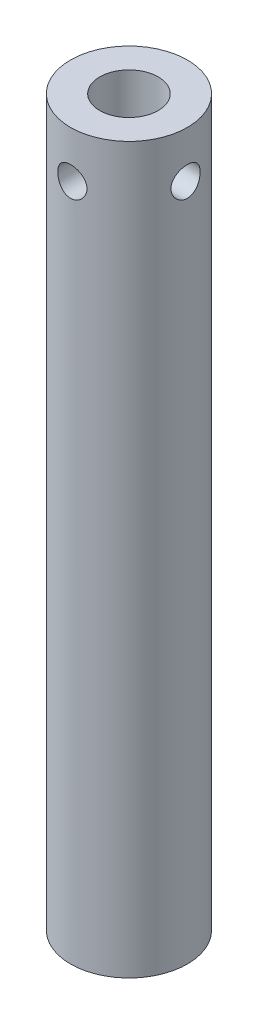
ISO-10303-21;
HEADER;
FILE_DESCRIPTION(('STEP AP214'),'2;1');
FILE_NAME('part.step','',(''),(''),'','','');
FILE_SCHEMA(('AUTOMOTIVE_DESIGN { 1 0 10303 214 1 1 1 1 }'));
ENDSEC;
DATA;
#1=APPLICATION_CONTEXT('core data for automotive mechanical design processes');
#2=APPLICATION_PROTOCOL_DEFINITION('international standard','automotive_design',2000,#1);
#3=PRODUCT_CONTEXT('',#1,'mechanical');
#4=PRODUCT('Part','Part','',(#3));
#5=PRODUCT_RELATED_PRODUCT_CATEGORY('part','',(#4));
#6=PRODUCT_DEFINITION_FORMATION('','',#4);
#7=PRODUCT_DEFINITION_CONTEXT('part definition',#1,'design');
#8=PRODUCT_DEFINITION('design','',#6,#7);
#9=PRODUCT_DEFINITION_SHAPE('','',#8);
#10=(LENGTH_UNIT() NAMED_UNIT(*) SI_UNIT(.MILLI.,.METRE.));
#11=(NAMED_UNIT(*) PLANE_ANGLE_UNIT() SI_UNIT($,.RADIAN.));
#12=(NAMED_UNIT(*) SI_UNIT($,.STERADIAN.) SOLID_ANGLE_UNIT());
#13=UNCERTAINTY_MEASURE_WITH_UNIT(LENGTH_MEASURE(1.E-05),#10,'distance_accuracy_value','');
#14=(GEOMETRIC_REPRESENTATION_CONTEXT(3) GLOBAL_UNCERTAINTY_ASSIGNED_CONTEXT((#13)) GLOBAL_UNIT_ASSIGNED_CONTEXT((#10,
#11,#12)) REPRESENTATION_CONTEXT('',''));
#15=CARTESIAN_POINT('',(0.,0.,0.));
#16=DIRECTION('',(0.,0.,1.));
#17=DIRECTION('',(1.,0.,0.));
#18=AXIS2_PLACEMENT_3D('',#15,#16,#17);
#19=CARTESIAN_POINT('',(0.,62.,0.));
#20=DIRECTION('',(0.,-1.,0.));
#21=DIRECTION('',(0.,0.,-1.));
#22=AXIS2_PLACEMENT_3D('',#19,#20,#21);
#23=CYLINDRICAL_SURFACE('',#22,5.);
#24=CARTESIAN_POINT('',(4.84122918275927,58.,-1.24999999999999));
#25=CARTESIAN_POINT('',(4.84123050042654,57.9309746245377,-1.24999803929588));
#26=CARTESIAN_POINT('',(4.84272153006957,57.861927550661,-1.24426312274865));
#27=CARTESIAN_POINT('',(4.84850930996624,57.725816210913,-1.22151156273207));
#28=CARTESIAN_POINT('',(4.85280769310907,57.6587531227658,-1.20448835337109));
#29=CARTESIAN_POINT('',(4.86369362297984,57.5285982309065,-1.15974559981597));
#30=CARTESIAN_POINT('',(4.87027821345204,57.4655014223072,-1.13203986392723));
#31=CARTESIAN_POINT('',(4.88499096014404,57.34484457373,-1.0667605706307));
#32=CARTESIAN_POINT('',(4.89311918189251,57.2872847689599,-1.02918659428035));
#33=CARTESIAN_POINT('',(4.91020358177806,57.1780691773689,-0.944354213655936));
#34=CARTESIAN_POINT('',(4.91917298811515,57.126553199825,-0.896918443852022));
#35=CARTESIAN_POINT('',(4.93681437757649,57.0321193028198,-0.79409103205033));
#36=CARTESIAN_POINT('',(4.94548633283195,56.9892021871891,-0.738698647090153));
#37=CARTESIAN_POINT('',(4.96170207760291,56.9126122661844,-0.62057260053948));
#38=CARTESIAN_POINT('',(4.96922843700296,56.8790768059193,-0.557747288097565));
#39=CARTESIAN_POINT('',(4.98215405962992,56.8230951779235,-0.427131592146387));
#40=CARTESIAN_POINT('',(4.98755363667172,56.8006473740422,-0.359341942895976));
#41=CARTESIAN_POINT('',(4.9955237942409,56.7679260827107,-0.222179379377086));
#42=CARTESIAN_POINT('',(4.99814946922157,56.7574151778367,-0.152866359774493));
#43=CARTESIAN_POINT('',(5.00046797053649,56.7481208103622,-0.0134144096313907));
#44=CARTESIAN_POINT('',(5.00016123048352,56.7493356138952,0.0567243972690281));
#45=CARTESIAN_POINT('',(4.99669047476767,56.7632874251251,0.194190308965478));
#46=CARTESIAN_POINT('',(4.99359001170437,56.7757681625269,0.261545269501328));
#47=CARTESIAN_POINT('',(4.98495418262427,56.8114856350242,0.393172809267101));
#48=CARTESIAN_POINT('',(4.9794186869922,56.8347229426887,0.45744522421304));
#49=CARTESIAN_POINT('',(4.96643754850448,56.8915012853435,0.581758379377251));
#50=CARTESIAN_POINT('',(4.95897509847527,56.9251335223309,0.641755637208124));
#51=CARTESIAN_POINT('',(4.94294951904825,57.0016778395581,0.755344527925604));
#52=CARTESIAN_POINT('',(4.93438619826245,57.0445915342803,0.808935043856874));
#53=CARTESIAN_POINT('',(4.9168185688476,57.1398543709912,0.909717543856188));
#54=CARTESIAN_POINT('',(4.90780859762959,57.1924274461739,0.956697098843993));
#55=CARTESIAN_POINT('',(4.89057521758353,57.3047999867701,1.04122046995377));
#56=CARTESIAN_POINT('',(4.88235184552985,57.3645997897455,1.07876384505751));
#57=CARTESIAN_POINT('',(4.86760248415824,57.4901450170745,1.14348516127824));
#58=CARTESIAN_POINT('',(4.86108491862861,57.5559178651566,1.1706119587131));
#59=CARTESIAN_POINT('',(4.85059320069979,57.6912927340382,1.21335702579542));
#60=CARTESIAN_POINT('',(4.84661850405109,57.7608939319916,1.22897775819113));
#61=CARTESIAN_POINT('',(4.8417767801957,57.8999797507615,1.24791481933258));
#62=CARTESIAN_POINT('',(4.84083044546824,57.9694188966648,1.25154523695981));
#63=CARTESIAN_POINT('',(4.8419367174052,58.1079109682891,1.24725849525777));
#64=CARTESIAN_POINT('',(4.84398904800633,58.1769639289756,1.23934239892439));
#65=CARTESIAN_POINT('',(4.8507854097728,58.3115571324773,1.21246273196883));
#66=CARTESIAN_POINT('',(4.85548485117188,58.3771363632854,1.19368203414087));
#67=CARTESIAN_POINT('',(4.86700359135481,58.5042157289258,1.14580904083531));
#68=CARTESIAN_POINT('',(4.87382314124307,58.5657153795277,1.11671552385627));
#69=CARTESIAN_POINT('',(4.88898068546631,58.6842206389337,1.04838533396828));
#70=CARTESIAN_POINT('',(4.89734584303321,58.7411144200215,1.00896087691782));
#71=CARTESIAN_POINT('',(4.91458541535858,58.8475941814007,0.92132536616807));
#72=CARTESIAN_POINT('',(4.92345991364235,58.897178958325,0.873112868506799));
#73=CARTESIAN_POINT('',(4.94098701515803,58.9889055212855,0.767828401230906));
#74=CARTESIAN_POINT('',(4.94962851030918,59.0308300312744,0.71056494066449));
#75=CARTESIAN_POINT('',(4.96548608306867,59.1044679334756,0.589628353368344));
#76=CARTESIAN_POINT('',(4.9727022350198,59.1361818583041,0.52595556119699));
#77=CARTESIAN_POINT('',(4.98485057869157,59.188223017264,0.394447752163865));
#78=CARTESIAN_POINT('',(4.98979915011205,59.2086321421895,0.326646726284855));
#79=CARTESIAN_POINT('',(4.99692646697894,59.2377301673042,0.188437200398514));
#80=CARTESIAN_POINT('',(4.99910574696704,59.2464213293695,0.11802920630156));
#81=CARTESIAN_POINT('',(5.00042711761014,59.2517094869694,-0.0213544080541514));
#82=CARTESIAN_POINT('',(4.9996497360001,59.2486271363692,-0.0903172837075344));
#83=CARTESIAN_POINT('',(4.9953237057178,59.2311902158821,-0.226709370518417));
#84=CARTESIAN_POINT('',(4.99177513946369,59.2168359812336,-0.294138627226101));
#85=CARTESIAN_POINT('',(4.98231791067453,59.1774347252863,-0.425213794556013));
#86=CARTESIAN_POINT('',(4.97642205628333,59.1524456833567,-0.488878118226267));
#87=CARTESIAN_POINT('',(4.9628911114173,59.0925367762258,-0.611146316301828));
#88=CARTESIAN_POINT('',(4.9552558017217,59.057615659163,-0.669749551581306));
#89=CARTESIAN_POINT('',(4.93884062101666,58.9778559575036,-0.781752410529865));
#90=CARTESIAN_POINT('',(4.93003771182014,58.9327998213658,-0.834993735375722));
#91=CARTESIAN_POINT('',(4.91238311316553,58.8344714350327,-0.93326877533906));
#92=CARTESIAN_POINT('',(4.90353141190695,58.7811971048776,-0.978300406335228));
#93=CARTESIAN_POINT('',(4.88659344825685,58.6667482322483,-1.05970253309903));
#94=CARTESIAN_POINT('',(4.87852454662356,58.6054448457342,-1.09589577430818));
#95=CARTESIAN_POINT('',(4.8642994443827,58.4774306375966,-1.15740862076957));
#96=CARTESIAN_POINT('',(4.85814185308379,58.4107237923666,-1.18273613719964));
#97=CARTESIAN_POINT('',(4.84939885924729,58.2867787352166,-1.21802816070679));
#98=CARTESIAN_POINT('',(4.84635828750683,58.2301335445202,-1.22999146324422));
#99=CARTESIAN_POINT('',(4.84227298231965,58.11566391375,-1.24597786571658));
#100=CARTESIAN_POINT('',(4.84122807862454,58.0578395746937,-1.25000164296522));
#101=CARTESIAN_POINT('',(4.84122918275927,58.,-1.24999999999999));
#102=B_SPLINE_CURVE_WITH_KNOTS('',3,(#24,#25,#26,#27,#28,#29,#30,#31,#32,#33,#34,#35,#36,#37,
#38,#39,#40,#41,#42,#43,#44,#45,#46,#47,#48,#49,#50,#51,#52,#53,#54,#55,#56,#57,#58,#59,#60,#61,
#62,#63,#64,#65,#66,#67,#68,#69,#70,#71,#72,#73,#74,#75,#76,#77,#78,#79,#80,#81,#82,#83,#84,#85,
#86,#87,#88,#89,#90,#91,#92,#93,#94,#95,#96,#97,#98,#99,#100,#101),.UNSPECIFIED.,.T.,.F.,(4,2,2,
2,2,2,2,2,2,2,2,2,2,2,2,2,2,2,2,2,2,2,2,2,2,2,2,2,2,2,2,2,2,2,2,2,2,2,4),(0.,0.206863720868061,
0.413847870714328,0.620565363583002,0.827291633777377,1.03811977096488,1.24896760739932,
1.46275748198959,1.67651579923545,1.88594375497672,2.09534074333009,2.30009131344472,
2.50485278362392,2.71146437127221,2.91811192734455,3.13035233285955,3.34260265599899,
3.55588216004198,3.76911600064771,3.97671787380857,4.18430063591899,4.38848702504601,
4.59269760710706,4.80091422929576,5.00916509442519,5.22262665482657,5.43607707859774,
5.64796036403462,5.85980274454516,6.06591723063725,6.27202558688487,6.47702438279852,
6.68204902869033,6.89198548291032,7.10197515782751,7.31588238642335,7.52963360683305,
7.70298913588661,7.87632987549757),.UNSPECIFIED.);
#103=CARTESIAN_POINT('',(4.84122918275927,58.,-1.24999999999999));
#104=VERTEX_POINT('',#103);
#105=EDGE_CURVE('E112',#104,#104,#102,.T.);
#106=ORIENTED_EDGE('',*,*,#105,.T.);
#107=EDGE_LOOP('',(#106));
#108=FACE_BOUND('',#107,.T.);
#109=CARTESIAN_POINT('',(1.25,58.,4.84122918275927));
#110=CARTESIAN_POINT('',(1.24999803929589,57.9309746245377,4.84123050042654));
#111=CARTESIAN_POINT('',(1.24426312274865,57.861927550661,4.84272153006957));
#112=CARTESIAN_POINT('',(1.22151156273207,57.725816210913,4.84850930996624));
#113=CARTESIAN_POINT('',(1.2044883533711,57.6587531227658,4.85280769310907));
#114=CARTESIAN_POINT('',(1.15974559981597,57.5285982309065,4.86369362297984));
#115=CARTESIAN_POINT('',(1.13203986392723,57.4655014223072,4.87027821345204));
#116=CARTESIAN_POINT('',(1.0667605706307,57.34484457373,4.88499096014404));
#117=CARTESIAN_POINT('',(1.02918659428034,57.2872847689599,4.89311918189251));
#118=CARTESIAN_POINT('',(0.944354213655936,57.1780691773689,4.91020358177806));
#119=CARTESIAN_POINT('',(0.896918443852024,57.126553199825,4.91917298811515));
#120=CARTESIAN_POINT('',(0.794091032050332,57.0321193028198,4.93681437757649));
#121=CARTESIAN_POINT('',(0.738698647090153,56.9892021871891,4.94548633283195));
#122=CARTESIAN_POINT('',(0.620572600539476,56.9126122661844,4.96170207760291));
#123=CARTESIAN_POINT('',(0.557747288097559,56.8790768059193,4.96922843700296));
#124=CARTESIAN_POINT('',(0.42713159214638,56.8230951779234,4.98215405962992));
#125=CARTESIAN_POINT('',(0.35934194289597,56.8006473740422,4.98755363667172));
#126=CARTESIAN_POINT('',(0.222179379377081,56.7679260827107,4.9955237942409));
#127=CARTESIAN_POINT('',(0.152866359774488,56.7574151778367,4.99814946922157));
#128=CARTESIAN_POINT('',(0.0134144096313852,56.7481208103622,5.00046797053649));
#129=CARTESIAN_POINT('',(-0.0567243972690335,56.7493356138952,5.00016123048352));
#130=CARTESIAN_POINT('',(-0.194190308965484,56.7632874251251,4.99669047476767));
#131=CARTESIAN_POINT('',(-0.261545269501334,56.7757681625269,4.99359001170437));
#132=CARTESIAN_POINT('',(-0.393172809267109,56.8114856350242,4.98495418262427));
#133=CARTESIAN_POINT('',(-0.457445224213048,56.8347229426887,4.9794186869922));
#134=CARTESIAN_POINT('',(-0.581758379377259,56.8915012853435,4.96643754850448));
#135=CARTESIAN_POINT('',(-0.641755637208132,56.9251335223309,4.95897509847527));
#136=CARTESIAN_POINT('',(-0.755344527925611,57.0016778395581,4.94294951904825));
#137=CARTESIAN_POINT('',(-0.808935043856881,57.0445915342803,4.93438619826245));
#138=CARTESIAN_POINT('',(-0.909717543856193,57.1398543709912,4.9168185688476));
#139=CARTESIAN_POINT('',(-0.956697098843997,57.1924274461739,4.90780859762959));
#140=CARTESIAN_POINT('',(-1.04122046995377,57.3047999867701,4.89057521758353));
#141=CARTESIAN_POINT('',(-1.07876384505752,57.3645997897455,4.88235184552985));
#142=CARTESIAN_POINT('',(-1.14348516127825,57.4901450170745,4.86760248415824));
#143=CARTESIAN_POINT('',(-1.17061195871311,57.5559178651566,4.8610849186286));
#144=CARTESIAN_POINT('',(-1.21335702579542,57.6912927340382,4.85059320069979));
#145=CARTESIAN_POINT('',(-1.22897775819113,57.7608939319916,4.84661850405109));
#146=CARTESIAN_POINT('',(-1.24791481933259,57.8999797507616,4.8417767801957));
#147=CARTESIAN_POINT('',(-1.25154523695981,57.9694188966648,4.84083044546824));
#148=CARTESIAN_POINT('',(-1.24725849525777,58.1079109682891,4.8419367174052));
#149=CARTESIAN_POINT('',(-1.2393423989244,58.1769639289756,4.84398904800633));
#150=CARTESIAN_POINT('',(-1.21246273196883,58.3115571324773,4.8507854097728));
#151=CARTESIAN_POINT('',(-1.19368203414087,58.3771363632854,4.85548485117188));
#152=CARTESIAN_POINT('',(-1.14580904083531,58.5042157289258,4.86700359135481));
#153=CARTESIAN_POINT('',(-1.11671552385627,58.5657153795277,4.87382314124307));
#154=CARTESIAN_POINT('',(-1.04838533396828,58.6842206389337,4.88898068546631));
#155=CARTESIAN_POINT('',(-1.00896087691781,58.7411144200215,4.89734584303321));
#156=CARTESIAN_POINT('',(-0.921325366168066,58.8475941814007,4.91458541535858));
#157=CARTESIAN_POINT('',(-0.873112868506796,58.897178958325,4.92345991364235));
#158=CARTESIAN_POINT('',(-0.767828401230906,58.9889055212855,4.94098701515803));
#159=CARTESIAN_POINT('',(-0.71056494066449,59.0308300312744,4.94962851030918));
#160=CARTESIAN_POINT('',(-0.589628353368343,59.1044679334756,4.96548608306867));
#161=CARTESIAN_POINT('',(-0.525955561196987,59.1361818583041,4.9727022350198));
#162=CARTESIAN_POINT('',(-0.39444775216386,59.188223017264,4.98485057869157));
#163=CARTESIAN_POINT('',(-0.326646726284848,59.2086321421895,4.98979915011205));
#164=CARTESIAN_POINT('',(-0.188437200398506,59.2377301673042,4.99692646697894));
#165=CARTESIAN_POINT('',(-0.118029206301551,59.2464213293695,4.99910574696704));
#166=CARTESIAN_POINT('',(0.0213544080541615,59.2517094869694,5.00042711761014));
#167=CARTESIAN_POINT('',(0.0903172837075452,59.2486271363692,4.9996497360001));
#168=CARTESIAN_POINT('',(0.226709370518428,59.2311902158821,4.9953237057178));
#169=CARTESIAN_POINT('',(0.294138627226111,59.2168359812336,4.99177513946369));
#170=CARTESIAN_POINT('',(0.425213794556021,59.1774347252863,4.98231791067453));
#171=CARTESIAN_POINT('',(0.488878118226274,59.1524456833567,4.97642205628333));
#172=CARTESIAN_POINT('',(0.611146316301835,59.0925367762258,4.9628911114173));
#173=CARTESIAN_POINT('',(0.669749551581314,59.057615659163,4.9552558017217));
#174=CARTESIAN_POINT('',(0.781752410529876,58.9778559575036,4.93884062101666));
#175=CARTESIAN_POINT('',(0.834993735375734,58.9327998213658,4.93003771182014));
#176=CARTESIAN_POINT('',(0.933268775339073,58.8344714350327,4.91238311316552));
#177=CARTESIAN_POINT('',(0.978300406335241,58.7811971048776,4.90353141190695));
#178=CARTESIAN_POINT('',(1.05970253309904,58.6667482322483,4.88659344825685));
#179=CARTESIAN_POINT('',(1.09589577430819,58.6054448457342,4.87852454662356));
#180=CARTESIAN_POINT('',(1.15740862076958,58.4774306375966,4.8642994443827));
#181=CARTESIAN_POINT('',(1.18273613719965,58.4107237923666,4.85814185308378));
#182=CARTESIAN_POINT('',(1.2180281607068,58.2867787352166,4.84939885924729));
#183=CARTESIAN_POINT('',(1.22999146324422,58.2301335445202,4.84635828750683));
#184=CARTESIAN_POINT('',(1.24597786571659,58.11566391375,4.84227298231965));
#185=CARTESIAN_POINT('',(1.25000164296523,58.0578395746937,4.84122807862454));
#186=CARTESIAN_POINT('',(1.25,58.,4.84122918275927));
#187=B_SPLINE_CURVE_WITH_KNOTS('',3,(#109,#110,#111,#112,#113,#114,#115,#116,#117,#118,#119,
#120,#121,#122,#123,#124,#125,#126,#127,#128,#129,#130,#131,#132,#133,#134,#135,#136,#137,#138,
#139,#140,#141,#142,#143,#144,#145,#146,#147,#148,#149,#150,#151,#152,#153,#154,#155,#156,#157,
#158,#159,#160,#161,#162,#163,#164,#165,#166,#167,#168,#169,#170,#171,#172,#173,#174,#175,#176,
#177,#178,#179,#180,#181,#182,#183,#184,#185,#186),.UNSPECIFIED.,.T.,.F.,(4,2,2,2,2,2,2,2,2,2,2,
2,2,2,2,2,2,2,2,2,2,2,2,2,2,2,2,2,2,2,2,2,2,2,2,2,2,2,4),(0.,0.206863720868061,
0.413847870714335,0.620565363583012,0.827291633777394,1.03811977096488,1.24896760739933,
1.4627574819896,1.67651579923546,1.88594375497673,2.0953407433301,2.30009131344474,
2.50485278362393,2.71146437127222,2.91811192734457,3.13035233285955,3.342602655999,
3.55588216004201,3.76911600064773,3.97671787380858,4.18430063591901,4.38848702504603,
4.59269760710709,4.80091422929579,5.00916509442522,5.22262665482659,5.43607707859777,
5.64796036403465,5.85980274454519,6.06591723063728,6.2720255868849,6.47702438279855,
6.68204902869036,6.89198548291035,7.10197515782754,7.31588238642338,7.52963360683309,
7.70298913588664,7.8763298754976),.UNSPECIFIED.);
#188=CARTESIAN_POINT('',(1.25,58.,4.84122918275927));
#189=VERTEX_POINT('',#188);
#190=EDGE_CURVE('E60',#189,#189,#187,.T.);
#191=ORIENTED_EDGE('',*,*,#190,.T.);
#192=EDGE_LOOP('',(#191));
#193=FACE_BOUND('',#192,.T.);
#194=CARTESIAN_POINT('',(0.,62.,0.));
#195=DIRECTION('',(0.,1.,0.));
#196=DIRECTION('',(0.,0.,1.));
#197=AXIS2_PLACEMENT_3D('',#194,#195,#196);
#198=CIRCLE('',#197,5.);
#199=CARTESIAN_POINT('',(0.,62.,5.));
#200=VERTEX_POINT('',#199);
#201=EDGE_CURVE('E10',#200,#200,#198,.T.);
#202=ORIENTED_EDGE('',*,*,#201,.F.);
#203=EDGE_LOOP('',(#202));
#204=FACE_BOUND('',#203,.T.);
#205=CARTESIAN_POINT('',(0.,0.,0.));
#206=DIRECTION('',(0.,1.,0.));
#207=DIRECTION('',(0.,0.,1.));
#208=AXIS2_PLACEMENT_3D('',#205,#206,#207);
#209=CIRCLE('',#208,5.);
#210=CARTESIAN_POINT('',(0.,0.,5.));
#211=VERTEX_POINT('',#210);
#212=EDGE_CURVE('E45',#211,#211,#209,.T.);
#213=ORIENTED_EDGE('',*,*,#212,.T.);
#214=EDGE_LOOP('',(#213));
#215=FACE_BOUND('',#214,.T.);
#216=ADVANCED_FACE('F41',(#108,#193,#204,#215),#23,.T.);
#217=CARTESIAN_POINT('',(0.,62.,0.));
#218=DIRECTION('',(0.,1.,0.));
#219=DIRECTION('',(0.,0.,1.));
#220=AXIS2_PLACEMENT_3D('',#217,#218,#219);
#221=PLANE('',#220);
#222=CARTESIAN_POINT('',(0.,62.,0.));
#223=DIRECTION('',(0.,1.,0.));
#224=DIRECTION('',(0.,0.,1.));
#225=AXIS2_PLACEMENT_3D('',#222,#223,#224);
#226=CIRCLE('',#225,2.5);
#227=CARTESIAN_POINT('',(0.,62.,2.5));
#228=VERTEX_POINT('',#227);
#229=EDGE_CURVE('E56',#228,#228,#226,.T.);
#230=ORIENTED_EDGE('',*,*,#229,.F.);
#231=EDGE_LOOP('',(#230));
#232=FACE_BOUND('',#231,.T.);
#233=ORIENTED_EDGE('',*,*,#201,.T.);
#234=EDGE_LOOP('',(#233));
#235=FACE_BOUND('',#234,.T.);
#236=ADVANCED_FACE('F97',(#232,#235),#221,.T.);
#237=CARTESIAN_POINT('',(0.,0.,0.));
#238=DIRECTION('',(0.,1.,0.));
#239=DIRECTION('',(0.,0.,1.));
#240=AXIS2_PLACEMENT_3D('',#237,#238,#239);
#241=PLANE('',#240);
#242=ORIENTED_EDGE('',*,*,#212,.F.);
#243=EDGE_LOOP('',(#242));
#244=FACE_BOUND('',#243,.T.);
#245=ADVANCED_FACE('F95',(#244),#241,.F.);
#246=CARTESIAN_POINT('',(0.,36.,0.));
#247=DIRECTION('',(0.,1.,0.));
#248=DIRECTION('',(0.,0.,1.));
#249=AXIS2_PLACEMENT_3D('',#246,#247,#248);
#250=CYLINDRICAL_SURFACE('',#249,2.5);
#251=CARTESIAN_POINT('',(2.1650635094611,58.,-1.24999999999999));
#252=CARTESIAN_POINT('',(2.16506918410574,58.0651347602441,-1.24999545384316));
#253=CARTESIAN_POINT('',(2.16804751484696,58.1303517644063,-1.24487496341651));
#254=CARTESIAN_POINT('',(2.17952958065066,58.2587840808464,-1.22465401237256));
#255=CARTESIAN_POINT('',(2.1880449256945,58.3219948938043,-1.20953258069272));
#256=CARTESIAN_POINT('',(2.20936683256748,58.4443145804299,-1.17012493587476));
#257=CARTESIAN_POINT('',(2.22215054341565,58.503443315592,-1.14588744061716));
#258=CARTESIAN_POINT('',(2.25053331021073,58.6167802524959,-1.08908440672046));
#259=CARTESIAN_POINT('',(2.26613251845081,58.6709881878281,-1.05651841754471));
#260=CARTESIAN_POINT('',(2.29996086321802,58.7778821606969,-0.980833175663592));
#261=CARTESIAN_POINT('',(2.31830079547442,58.8300739195919,-0.93706504517971));
#262=CARTESIAN_POINT('',(2.35464978482132,58.9267604855084,-0.841567259518083));
#263=CARTESIAN_POINT('',(2.37265867289063,58.9712514532294,-0.789833657227862));
#264=CARTESIAN_POINT('',(2.40776846191186,59.0542089389346,-0.675611954268178));
#265=CARTESIAN_POINT('',(2.42472633022716,59.0920672098244,-0.612633986265715));
#266=CARTESIAN_POINT('',(2.45438445124411,59.1564260665572,-0.480196283249379));
#267=CARTESIAN_POINT('',(2.46708738979677,59.1829338201715,-0.410740672672694));
#268=CARTESIAN_POINT('',(2.48600576555297,59.2218808266264,-0.272556179907473));
#269=CARTESIAN_POINT('',(2.49261850276115,59.2351869079444,-0.204127238111023));
#270=CARTESIAN_POINT('',(2.50009479807584,59.2502076483438,-0.0657132858723117));
#271=CARTESIAN_POINT('',(2.50096183480737,59.2519293209946,0.00427075730467094));
#272=CARTESIAN_POINT('',(2.49703727395563,59.244066657537,0.137290655529685));
#273=CARTESIAN_POINT('',(2.49273119865201,59.2354524805985,0.200401498970987));
#274=CARTESIAN_POINT('',(2.47967806574684,59.2088989451192,0.324142214897899));
#275=CARTESIAN_POINT('',(2.47093067582992,59.1909588887797,0.384771901367403));
#276=CARTESIAN_POINT('',(2.44964479109568,59.1461467923877,0.502886739461937));
#277=CARTESIAN_POINT('',(2.43705551911499,59.1191546085349,0.560316779393968));
#278=CARTESIAN_POINT('',(2.40922057483359,59.0571707297481,0.669971001891656));
#279=CARTESIAN_POINT('',(2.39397395196855,59.0221761708721,0.722193311048303));
#280=CARTESIAN_POINT('',(2.36055492999037,58.9413808105837,0.825217076122739));
#281=CARTESIAN_POINT('',(2.34224219997719,58.8948712145925,0.875417593786695));
#282=CARTESIAN_POINT('',(2.30567925733515,58.7942628438373,0.967630462872219));
#283=CARTESIAN_POINT('',(2.28742910332036,58.7401582846574,1.00963651446778));
#284=CARTESIAN_POINT('',(2.25180195115606,58.6216897594699,1.08688166830276));
#285=CARTESIAN_POINT('',(2.23455399988385,58.5568924711822,1.12152164372256));
#286=CARTESIAN_POINT('',(2.2046931284822,58.4213279108012,1.17914889125153));
#287=CARTESIAN_POINT('',(2.19207537557585,58.350566958728,1.20214832276361));
#288=CARTESIAN_POINT('',(2.17430794771293,58.2109818608965,1.2339752637813));
#289=CARTESIAN_POINT('',(2.16864569810621,58.1424486011956,1.24378140264996));
#290=CARTESIAN_POINT('',(2.16397399202012,58.0044983231043,1.25189618326428));
#291=CARTESIAN_POINT('',(2.1649598361164,57.9350819636003,1.25021294664378));
#292=CARTESIAN_POINT('',(2.17292920675731,57.8054326017766,1.23629505417995));
#293=CARTESIAN_POINT('',(2.17924484383318,57.7450256861151,1.22523477089058));
#294=CARTESIAN_POINT('',(2.19617526939177,57.6270402671613,1.19462035579055));
#295=CARTESIAN_POINT('',(2.20679145006293,57.5694626865667,1.17506347327951));
#296=CARTESIAN_POINT('',(2.23170277599571,57.4557358363716,1.1270594857561));
#297=CARTESIAN_POINT('',(2.24614554053829,57.3997762289331,1.0982425796159));
#298=CARTESIAN_POINT('',(2.27695149371562,57.2931634105763,1.03285883001975));
#299=CARTESIAN_POINT('',(2.29331566693935,57.2425129456084,0.996288005415266));
#300=CARTESIAN_POINT('',(2.3285999807042,57.1412765405956,0.911046458998564));
#301=CARTESIAN_POINT('',(2.34758228942861,57.0915035616029,0.861431590393706));
#302=CARTESIAN_POINT('',(2.38417793722366,57.000734702508,0.754255619247858));
#303=CARTESIAN_POINT('',(2.40179081259637,56.9597417872118,0.69669184331918));
#304=CARTESIAN_POINT('',(2.43426702113696,56.8867828425624,0.573169203198444));
#305=CARTESIAN_POINT('',(2.44904552090037,56.8550836022364,0.507028871967639));
#306=CARTESIAN_POINT('',(2.47354193699126,56.8035776201783,0.369402955801351));
#307=CARTESIAN_POINT('',(2.48326429595466,56.7837604357921,0.297922126740218));
#308=CARTESIAN_POINT('',(2.49584385227353,56.7582892947817,0.15872460291302));
#309=CARTESIAN_POINT('',(2.49924909885239,56.7515026551549,0.0912643048130702));
#310=CARTESIAN_POINT('',(2.50052662968914,56.748945918182,-0.0439074824390041));
#311=CARTESIAN_POINT('',(2.49840085083612,56.7531719643456,-0.111618875368857));
#312=CARTESIAN_POINT('',(2.48917461047403,56.7717705084945,-0.240672490396433));
#313=CARTESIAN_POINT('',(2.48241118334987,56.7854560615721,-0.302140397264079));
#314=CARTESIAN_POINT('',(2.46490117079279,56.8216587491287,-0.421807440229521));
#315=CARTESIAN_POINT('',(2.45415401415995,56.8441771501168,-0.480006106194384));
#316=CARTESIAN_POINT('',(2.4290741343515,56.8984088152075,-0.594279257806103));
#317=CARTESIAN_POINT('',(2.41460771498499,56.9304741540098,-0.650156428375055));
#318=CARTESIAN_POINT('',(2.38360166427283,57.0024474135738,-0.755968302267527));
#319=CARTESIAN_POINT('',(2.36706108197951,57.0423589363946,-0.80590025926863));
#320=CARTESIAN_POINT('',(2.33160762783285,57.1334964237784,-0.90364250519611));
#321=CARTESIAN_POINT('',(2.31262248764623,57.1854531093465,-0.950747105674085));
#322=CARTESIAN_POINT('',(2.27578845203566,57.2968134014122,-1.03582910924334));
#323=CARTESIAN_POINT('',(2.25794057202332,57.3562235260846,-1.07379843751257));
#324=CARTESIAN_POINT('',(2.22499506631145,57.4832958082262,-1.14053884973206));
#325=CARTESIAN_POINT('',(2.21000217820338,57.5511594139109,-1.16898133245117));
#326=CARTESIAN_POINT('',(2.1858269541044,57.6916655054247,-1.21359838688301));
#327=CARTESIAN_POINT('',(2.17662520184628,57.7642911111409,-1.22981398896918));
#328=CARTESIAN_POINT('',(2.16911590752238,57.864756694565,-1.24295875983051));
#329=CARTESIAN_POINT('',(2.1676016125644,57.8917098679974,-1.24559513120481));
#330=CARTESIAN_POINT('',(2.16557419859688,57.9457706008528,-1.24911675636245));
#331=CARTESIAN_POINT('',(2.16506114656387,57.9728781704823,-1.25000189299983));
#332=CARTESIAN_POINT('',(2.1650635094611,58.,-1.24999999999999));
#333=B_SPLINE_CURVE_WITH_KNOTS('',3,(#251,#252,#253,#254,#255,#256,#257,#258,#259,#260,#261,
#262,#263,#264,#265,#266,#267,#268,#269,#270,#271,#272,#273,#274,#275,#276,#277,#278,#279,#280,
#281,#282,#283,#284,#285,#286,#287,#288,#289,#290,#291,#292,#293,#294,#295,#296,#297,#298,#299,
#300,#301,#302,#303,#304,#305,#306,#307,#308,#309,#310,#311,#312,#313,#314,#315,#316,#317,#318,
#319,#320,#321,#322,#323,#324,#325,#326,#327,#328,#329,#330,#331,#332),.UNSPECIFIED.,.T.,.F.,(4,
2,2,2,2,2,2,2,2,2,2,2,2,2,2,2,2,2,2,2,2,2,2,2,2,2,2,2,2,2,2,2,2,2,2,2,2,2,2,2,4),(0.,
0.195290153243401,0.390991116031004,0.585660744898612,0.780340906806441,0.991077890622785,
1.20191963855463,1.42697365298454,1.65188533704863,1.86079356209918,2.06957529607549,
2.26020121855672,2.45084140646818,2.64411918413932,2.83746624187838,3.04908989321112,
3.26087560307396,3.48611052161809,3.7111096776463,3.91827863567763,4.12530116485464,
4.30967729280029,4.49411315545077,4.68709120507607,4.88016857775057,5.09758429475764,
5.3150733122275,5.53830226766205,5.76133474760962,5.96390337986856,6.16640108492461,
6.35555531089363,6.54473666890013,6.74200938399337,6.93937287625895,7.15637802312581,
7.37357428556439,7.59763436298252,7.82093916253447,7.90225168981633,7.98356965618172),.UNSPECIFIED.);
#334=CARTESIAN_POINT('',(2.1650635094611,58.,-1.24999999999999));
#335=VERTEX_POINT('',#334);
#336=EDGE_CURVE('E119',#335,#335,#333,.T.);
#337=ORIENTED_EDGE('',*,*,#336,.T.);
#338=EDGE_LOOP('',(#337));
#339=FACE_BOUND('',#338,.T.);
#340=CARTESIAN_POINT('',(0.,56.75,2.5));
#341=CARTESIAN_POINT('',(0.0657149536912329,56.7500041278994,2.49999641755189));
#342=CARTESIAN_POINT('',(0.13150824962254,56.7552125914021,2.49738113774397));
#343=CARTESIAN_POINT('',(0.261150294085531,56.7758161004261,2.48717695046745));
#344=CARTESIAN_POINT('',(0.324995108391879,56.7912304912471,2.47957859786229));
#345=CARTESIAN_POINT('',(0.448666931100717,56.831492260771,2.4602034925414));
#346=CARTESIAN_POINT('',(0.508508503673973,56.85630298031,2.448442989719));
#347=CARTESIAN_POINT('',(0.623090771008204,56.9144632767062,2.42182220644723));
#348=CARTESIAN_POINT('',(0.677831867487561,56.9478121803111,2.40696217041913));
#349=CARTESIAN_POINT('',(0.784384772202399,57.0243965618566,2.37445322822571));
#350=CARTESIAN_POINT('',(0.835819013902639,57.0681080990496,2.3566899890942));
#351=CARTESIAN_POINT('',(0.93097430608372,57.1631518490588,2.3207496280843));
#352=CARTESIAN_POINT('',(0.974689478883456,57.2144898147155,2.30257220261294));
#353=CARTESIAN_POINT('',(1.05656500056285,57.3281041869042,2.26623688996684));
#354=CARTESIAN_POINT('',(1.09403166943955,57.3909201229324,2.24818983712665));
#355=CARTESIAN_POINT('',(1.15771028361337,57.5229591699828,2.21607473465401));
#356=CARTESIAN_POINT('',(1.18393026870792,57.5921776609034,2.20200384508737));
#357=CARTESIAN_POINT('',(1.22266555273573,57.7308313817774,2.18072333797261));
#358=CARTESIAN_POINT('',(1.23590732135055,57.8000055650842,2.17315339479642));
#359=CARTESIAN_POINT('',(1.25053374163606,57.9399735472243,2.1647736243566));
#360=CARTESIAN_POINT('',(1.25193011046634,58.0107656760889,2.1639571167911));
#361=CARTESIAN_POINT('',(1.24335910896537,58.1428575303942,2.16888662821561));
#362=CARTESIAN_POINT('',(1.23473069942103,58.2042800390288,2.17385954577517));
#363=CARTESIAN_POINT('',(1.20867481132117,58.3246523867163,2.18845285917313));
#364=CARTESIAN_POINT('',(1.19124452987207,58.3836014316316,2.1980747353972));
#365=CARTESIAN_POINT('',(1.14776222548251,58.4990364157071,2.22109345515926));
#366=CARTESIAN_POINT('',(1.12151883389499,58.5554329984822,2.23457300829998));
#367=CARTESIAN_POINT('',(1.061302109585,58.6632928657375,2.26379255351755));
#368=CARTESIAN_POINT('',(1.02732530476559,58.7147539195001,2.27953355975238));
#369=CARTESIAN_POINT('',(0.947582568640987,58.818151565929,2.31391447379107));
#370=CARTESIAN_POINT('',(0.900868072961603,58.8693210919702,2.33266887795933));
#371=CARTESIAN_POINT('',(0.799444473426718,58.9634192732386,2.36934529125509));
#372=CARTESIAN_POINT('',(0.744731570717858,59.0063439900423,2.38726689948501));
#373=CARTESIAN_POINT('',(0.625645632289813,59.0846070762872,2.42127484103705));
#374=CARTESIAN_POINT('',(0.560941989499263,59.1195005905572,2.43723730202509));
#375=CARTESIAN_POINT('',(0.425582769360997,59.1776212863038,2.46447351401553));
#376=CARTESIAN_POINT('',(0.354931970331596,59.200857731269,2.47575098679441));
#377=CARTESIAN_POINT('',(0.215958114575877,59.2330942546458,2.49155417176795));
#378=CARTESIAN_POINT('',(0.147926913185405,59.2431140446835,2.4965617287664));
#379=CARTESIAN_POINT('',(0.0109744999366928,59.2518309139181,2.50091266823877));
#380=CARTESIAN_POINT('',(-0.0579462748373752,59.2505333570493,2.5002587340164));
#381=CARTESIAN_POINT('',(-0.18904121498249,59.2372416394766,2.49363990316801));
#382=CARTESIAN_POINT('',(-0.251324260062441,59.2260843340875,2.48809057110237));
#383=CARTESIAN_POINT('',(-0.373008615377394,59.1947024101311,2.47277714143524));
#384=CARTESIAN_POINT('',(-0.432409607113744,59.1744767919333,2.46301257917916));
#385=CARTESIAN_POINT('',(-0.548610760562079,59.1250019169585,2.43980314267087));
#386=CARTESIAN_POINT('',(-0.60528799625769,59.095511187354,2.42626102212424));
#387=CARTESIAN_POINT('',(-0.713076702123649,59.0286155804424,2.39679967896386));
#388=CARTESIAN_POINT('',(-0.7641857872191,58.9912073317582,2.38087944457231));
#389=CARTESIAN_POINT('',(-0.864709611613315,58.9052994683339,2.34635276671831));
#390=CARTESIAN_POINT('',(-0.913465097280798,58.856071414433,2.32763606060552));
#391=CARTESIAN_POINT('',(-1.00232040139155,58.7500935609134,2.29077989504843));
#392=CARTESIAN_POINT('',(-1.04241423211355,58.6933386014795,2.27264084226908));
#393=CARTESIAN_POINT('',(-1.11463489312212,58.5704454322496,2.23813990282585));
#394=CARTESIAN_POINT('',(-1.1462818698483,58.5039859172392,2.2219066207934));
#395=CARTESIAN_POINT('',(-1.19760353251725,58.3656124153843,2.19467590460158));
#396=CARTESIAN_POINT('',(-1.21729364485946,58.2937055918735,2.18367172800773));
#397=CARTESIAN_POINT('',(-1.2423271093121,58.1538622214232,2.16951876260834));
#398=CARTESIAN_POINT('',(-1.24886624550108,58.0862071832137,2.16571729325614));
#399=CARTESIAN_POINT('',(-1.25086144297598,57.9506911660366,2.16456693307719));
#400=CARTESIAN_POINT('',(-1.2463223082805,57.8828302890757,2.16721524534441));
#401=CARTESIAN_POINT('',(-1.22740765699033,57.755645623085,2.17797327562531));
#402=CARTESIAN_POINT('',(-1.2140103929285,57.6961244123195,2.18553868102992));
#403=CARTESIAN_POINT('',(-1.1789691977808,57.5802398507191,2.20463770234897));
#404=CARTESIAN_POINT('',(-1.15732261394976,57.523877522385,2.21617259462095));
#405=CARTESIAN_POINT('',(-1.10476968162585,57.4117189362667,2.2428566295566));
#406=CARTESIAN_POINT('',(-1.07333892227057,57.3562151227129,2.25819652995238));
#407=CARTESIAN_POINT('',(-1.00268871454579,57.2509068297743,2.29044164543238));
#408=CARTESIAN_POINT('',(-0.963465214048307,57.2011053368519,2.30734767243153));
#409=CARTESIAN_POINT('',(-0.8727541583308,57.102322522053,2.34327903949141));
#410=CARTESIAN_POINT('',(-0.820355528762714,57.0541761220476,2.36231229139336));
#411=CARTESIAN_POINT('',(-0.707693507775351,56.9671712707205,2.3984719031886));
#412=CARTESIAN_POINT('',(-0.647425904070983,56.9283178257171,2.4155972326005));
#413=CARTESIAN_POINT('',(-0.519914496024935,56.8609545465472,2.44622511981379));
#414=CARTESIAN_POINT('',(-0.45262437991827,56.8325197882357,2.45970120703636));
#415=CARTESIAN_POINT('',(-0.313427626617741,56.7877397901013,2.48126676704332));
#416=CARTESIAN_POINT('',(-0.241534749528958,56.771360191463,2.48937154216165));
#417=CARTESIAN_POINT('',(-0.14075243310423,56.7576282361552,2.49619327387079));
#418=CARTESIAN_POINT('',(-0.112702349299374,56.7547716989205,2.49761706674002));
#419=CARTESIAN_POINT('',(-0.0564396647589472,56.750956668104,2.49952121222331));
#420=CARTESIAN_POINT('',(-0.0282270595592268,56.749998226911,2.50000153879704));
#421=CARTESIAN_POINT('',(0.,56.75,2.5));
#422=B_SPLINE_CURVE_WITH_KNOTS('',3,(#340,#341,#342,#343,#344,#345,#346,#347,#348,#349,#350,
#351,#352,#353,#354,#355,#356,#357,#358,#359,#360,#361,#362,#363,#364,#365,#366,#367,#368,#369,
#370,#371,#372,#373,#374,#375,#376,#377,#378,#379,#380,#381,#382,#383,#384,#385,#386,#387,#388,
#389,#390,#391,#392,#393,#394,#395,#396,#397,#398,#399,#400,#401,#402,#403,#404,#405,#406,#407,
#408,#409,#410,#411,#412,#413,#414,#415,#416,#417,#418,#419,#420,#421),.UNSPECIFIED.,.T.,.F.,(4,
2,2,2,2,2,2,2,2,2,2,2,2,2,2,2,2,2,2,2,2,2,2,2,2,2,2,2,2,2,2,2,2,2,2,2,2,2,2,2,4),(0.,
0.197030321775365,0.394435187136496,0.59107769436537,0.787704700726959,0.996227198397613,
1.20490779706754,1.42977158038441,1.65447434872851,1.86572515175286,2.07676696661276,
2.26257140511651,2.44843504907097,2.63862800210609,2.82890651575277,3.04331176667348,
3.25781918248358,3.48228777768051,3.7065777114035,3.91229113089182,4.11790705639345,
4.30758633132652,4.49728652038664,4.69241070034873,4.88761813435424,5.10199513305523,
5.31651985769289,5.54143352699592,5.76605639925972,5.96911634372967,6.17208824825007,
6.35572412805228,6.53941910979598,6.73545570969518,6.93159451423697,7.15156553440623,
7.37165479220715,7.59330017078656,7.81431135781162,7.89894100172122,7.98357298143558),.UNSPECIFIED.);
#423=CARTESIAN_POINT('',(0.,56.75,2.5));
#424=VERTEX_POINT('',#423);
#425=EDGE_CURVE('E71',#424,#424,#422,.T.);
#426=ORIENTED_EDGE('',*,*,#425,.T.);
#427=EDGE_LOOP('',(#426));
#428=FACE_BOUND('',#427,.T.);
#429=CARTESIAN_POINT('',(0.,36.,0.));
#430=DIRECTION('',(0.,1.,0.));
#431=DIRECTION('',(0.,0.,1.));
#432=AXIS2_PLACEMENT_3D('',#429,#430,#431);
#433=CIRCLE('',#432,2.5);
#434=CARTESIAN_POINT('',(0.,36.,2.5));
#435=VERTEX_POINT('',#434);
#436=EDGE_CURVE('E54',#435,#435,#433,.T.);
#437=ORIENTED_EDGE('',*,*,#436,.F.);
#438=EDGE_LOOP('',(#437));
#439=FACE_BOUND('',#438,.T.);
#440=ORIENTED_EDGE('',*,*,#229,.T.);
#441=EDGE_LOOP('',(#440));
#442=FACE_BOUND('',#441,.T.);
#443=ADVANCED_FACE('F91',(#339,#428,#439,#442),#250,.F.);
#444=CARTESIAN_POINT('',(0.,36.,0.));
#445=DIRECTION('',(0.,1.,0.));
#446=DIRECTION('',(0.,0.,1.));
#447=AXIS2_PLACEMENT_3D('',#444,#445,#446);
#448=PLANE('',#447);
#449=ORIENTED_EDGE('',*,*,#436,.T.);
#450=EDGE_LOOP('',(#449));
#451=FACE_BOUND('',#450,.T.);
#452=ADVANCED_FACE('F82',(#451),#448,.T.);
#453=CARTESIAN_POINT('',(0.,58.,5.));
#454=DIRECTION('',(0.,0.,1.));
#455=DIRECTION('',(1.,0.,0.));
#456=AXIS2_PLACEMENT_3D('',#453,#454,#455);
#457=CYLINDRICAL_SURFACE('',#456,1.25);
#458=ORIENTED_EDGE('',*,*,#425,.F.);
#459=EDGE_LOOP('',(#458));
#460=FACE_BOUND('',#459,.T.);
#461=ORIENTED_EDGE('',*,*,#190,.F.);
#462=EDGE_LOOP('',(#461));
#463=FACE_BOUND('',#462,.T.);
#464=ADVANCED_FACE('F77',(#460,#463),#457,.F.);
#465=CARTESIAN_POINT('',(5.,58.,0.));
#466=DIRECTION('',(1.,0.,0.));
#467=DIRECTION('',(0.,0.,-1.));
#468=AXIS2_PLACEMENT_3D('',#465,#466,#467);
#469=CYLINDRICAL_SURFACE('',#468,1.24999999999999);
#470=ORIENTED_EDGE('',*,*,#336,.F.);
#471=EDGE_LOOP('',(#470));
#472=FACE_BOUND('',#471,.T.);
#473=ORIENTED_EDGE('',*,*,#105,.F.);
#474=EDGE_LOOP('',(#473));
#475=FACE_BOUND('',#474,.T.);
#476=ADVANCED_FACE('F81',(#472,#475),#469,.F.);
#477=CLOSED_SHELL('',(#216,#236,#245,#443,#452,#464,#476));
#478=MANIFOLD_SOLID_BREP('B2',#477);
#479=ADVANCED_BREP_SHAPE_REPRESENTATION('',(#18,#478),#14);
#480=SHAPE_DEFINITION_REPRESENTATION(#9,#479);
ENDSEC;
END-ISO-10303-21;
